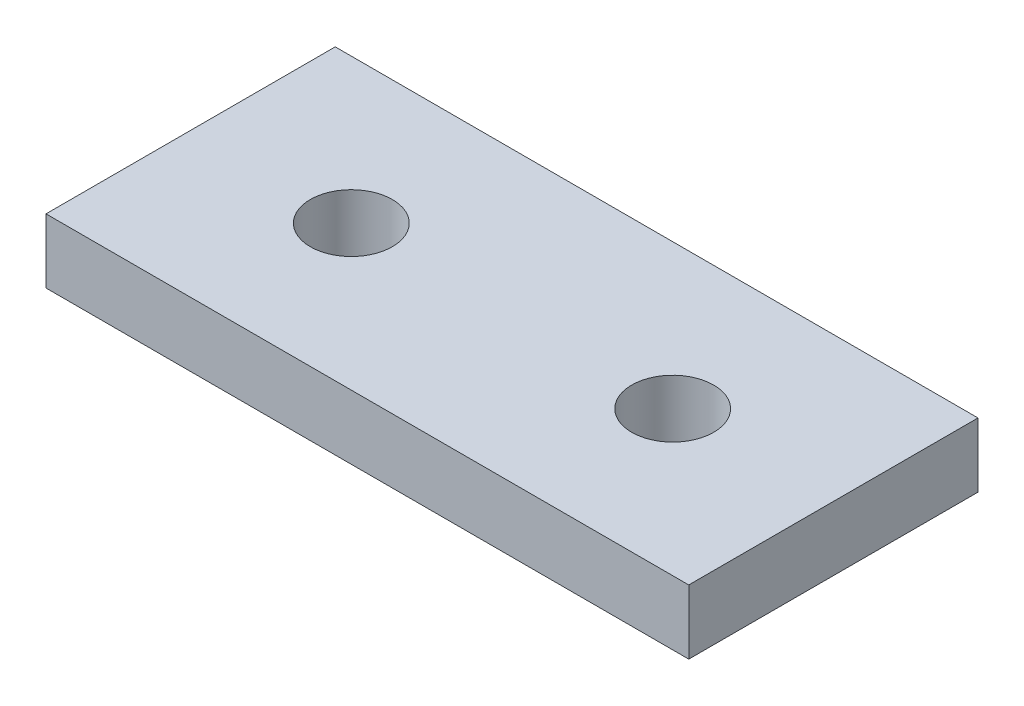
ISO-10303-21;
HEADER;
FILE_DESCRIPTION(('STEP AP214'),'2;1');
FILE_NAME('part.step','',(''),(''),'','','');
FILE_SCHEMA(('AUTOMOTIVE_DESIGN { 1 0 10303 214 1 1 1 1 }'));
ENDSEC;
DATA;
#1=APPLICATION_CONTEXT('core data for automotive mechanical design processes');
#2=APPLICATION_PROTOCOL_DEFINITION('international standard','automotive_design',2000,#1);
#3=PRODUCT_CONTEXT('',#1,'mechanical');
#4=PRODUCT('Part','Part','',(#3));
#5=PRODUCT_RELATED_PRODUCT_CATEGORY('part','',(#4));
#6=PRODUCT_DEFINITION_FORMATION('','',#4);
#7=PRODUCT_DEFINITION_CONTEXT('part definition',#1,'design');
#8=PRODUCT_DEFINITION('design','',#6,#7);
#9=PRODUCT_DEFINITION_SHAPE('','',#8);
#10=(LENGTH_UNIT() NAMED_UNIT(*) SI_UNIT(.MILLI.,.METRE.));
#11=(NAMED_UNIT(*) PLANE_ANGLE_UNIT() SI_UNIT($,.RADIAN.));
#12=(NAMED_UNIT(*) SI_UNIT($,.STERADIAN.) SOLID_ANGLE_UNIT());
#13=UNCERTAINTY_MEASURE_WITH_UNIT(LENGTH_MEASURE(1.E-05),#10,'distance_accuracy_value','');
#14=(GEOMETRIC_REPRESENTATION_CONTEXT(3) GLOBAL_UNCERTAINTY_ASSIGNED_CONTEXT((#13)) GLOBAL_UNIT_ASSIGNED_CONTEXT((#10,
#11,#12)) REPRESENTATION_CONTEXT('',''));
#15=CARTESIAN_POINT('',(0.,0.,0.));
#16=DIRECTION('',(0.,0.,1.));
#17=DIRECTION('',(1.,0.,0.));
#18=AXIS2_PLACEMENT_3D('',#15,#16,#17);
#19=CARTESIAN_POINT('',(0.,4.,0.));
#20=DIRECTION('',(0.,1.,0.));
#21=DIRECTION('',(0.,0.,1.));
#22=AXIS2_PLACEMENT_3D('',#19,#20,#21);
#23=PLANE('',#22);
#24=CARTESIAN_POINT('',(-10.,4.,0.));
#25=DIRECTION('',(0.,1.,0.));
#26=DIRECTION('',(0.,0.,1.));
#27=AXIS2_PLACEMENT_3D('',#24,#25,#26);
#28=CIRCLE('',#27,2.55);
#29=CARTESIAN_POINT('',(-10.,4.,2.55));
#30=VERTEX_POINT('',#29);
#31=EDGE_CURVE('E102',#30,#30,#28,.T.);
#32=ORIENTED_EDGE('',*,*,#31,.F.);
#33=EDGE_LOOP('',(#32));
#34=FACE_BOUND('',#33,.T.);
#35=DIRECTION('',(0.,0.,1.));
#36=VECTOR('',#35,1.);
#37=CARTESIAN_POINT('',(-20.,4.,9.));
#38=LINE('',#37,#36);
#39=CARTESIAN_POINT('',(-20.,4.,-9.));
#40=VERTEX_POINT('',#39);
#41=CARTESIAN_POINT('',(-20.,4.,9.));
#42=VERTEX_POINT('',#41);
#43=EDGE_CURVE('E87',#40,#42,#38,.T.);
#44=ORIENTED_EDGE('',*,*,#43,.T.);
#45=DIRECTION('',(1.,0.,0.));
#46=VECTOR('',#45,1.);
#47=CARTESIAN_POINT('',(20.,4.,8.99999999999999));
#48=LINE('',#47,#46);
#49=CARTESIAN_POINT('',(20.,4.,8.99999999999999));
#50=VERTEX_POINT('',#49);
#51=EDGE_CURVE('E82',#42,#50,#48,.T.);
#52=ORIENTED_EDGE('',*,*,#51,.T.);
#53=DIRECTION('',(0.,0.,-1.));
#54=VECTOR('',#53,1.);
#55=CARTESIAN_POINT('',(20.,4.,8.99999999999999));
#56=LINE('',#55,#54);
#57=CARTESIAN_POINT('',(20.,4.,-9.00000000000001));
#58=VERTEX_POINT('',#57);
#59=EDGE_CURVE('E85',#50,#58,#56,.T.);
#60=ORIENTED_EDGE('',*,*,#59,.T.);
#61=DIRECTION('',(-1.,0.,0.));
#62=VECTOR('',#61,1.);
#63=CARTESIAN_POINT('',(20.,4.,-9.00000000000001));
#64=LINE('',#63,#62);
#65=EDGE_CURVE('E52',#58,#40,#64,.T.);
#66=ORIENTED_EDGE('',*,*,#65,.T.);
#67=EDGE_LOOP('',(#44,#52,#60,#66));
#68=FACE_BOUND('',#67,.T.);
#69=CARTESIAN_POINT('',(9.99999999999999,4.,0.));
#70=DIRECTION('',(0.,1.,0.));
#71=DIRECTION('',(0.,0.,-1.));
#72=AXIS2_PLACEMENT_3D('',#69,#70,#71);
#73=CIRCLE('',#72,2.55);
#74=CARTESIAN_POINT('',(9.99999999999999,4.,-2.55));
#75=VERTEX_POINT('',#74);
#76=EDGE_CURVE('E117',#75,#75,#73,.T.);
#77=ORIENTED_EDGE('',*,*,#76,.F.);
#78=EDGE_LOOP('',(#77));
#79=FACE_BOUND('',#78,.T.);
#80=ADVANCED_FACE('F35',(#34,#68,#79),#23,.T.);
#81=CARTESIAN_POINT('',(0.,0.,0.));
#82=DIRECTION('',(0.,1.,0.));
#83=DIRECTION('',(0.,0.,1.));
#84=AXIS2_PLACEMENT_3D('',#81,#82,#83);
#85=PLANE('',#84);
#86=CARTESIAN_POINT('',(-10.,0.,0.));
#87=DIRECTION('',(0.,1.,0.));
#88=DIRECTION('',(0.,0.,1.));
#89=AXIS2_PLACEMENT_3D('',#86,#87,#88);
#90=CIRCLE('',#89,2.55);
#91=CARTESIAN_POINT('',(-10.,0.,2.55));
#92=VERTEX_POINT('',#91);
#93=EDGE_CURVE('E114',#92,#92,#90,.T.);
#94=ORIENTED_EDGE('',*,*,#93,.T.);
#95=EDGE_LOOP('',(#94));
#96=FACE_BOUND('',#95,.T.);
#97=DIRECTION('',(0.,0.,1.));
#98=VECTOR('',#97,1.);
#99=CARTESIAN_POINT('',(-20.,0.,9.));
#100=LINE('',#99,#98);
#101=CARTESIAN_POINT('',(-20.,0.,-9.));
#102=VERTEX_POINT('',#101);
#103=CARTESIAN_POINT('',(-20.,0.,9.));
#104=VERTEX_POINT('',#103);
#105=EDGE_CURVE('E99',#102,#104,#100,.T.);
#106=ORIENTED_EDGE('',*,*,#105,.F.);
#107=DIRECTION('',(-1.,0.,0.));
#108=VECTOR('',#107,1.);
#109=CARTESIAN_POINT('',(20.,0.,-9.00000000000001));
#110=LINE('',#109,#108);
#111=CARTESIAN_POINT('',(20.,0.,-9.00000000000001));
#112=VERTEX_POINT('',#111);
#113=EDGE_CURVE('E75',#112,#102,#110,.T.);
#114=ORIENTED_EDGE('',*,*,#113,.F.);
#115=DIRECTION('',(0.,0.,-1.));
#116=VECTOR('',#115,1.);
#117=CARTESIAN_POINT('',(20.,0.,8.99999999999999));
#118=LINE('',#117,#116);
#119=CARTESIAN_POINT('',(20.,0.,8.99999999999999));
#120=VERTEX_POINT('',#119);
#121=EDGE_CURVE('E69',#120,#112,#118,.T.);
#122=ORIENTED_EDGE('',*,*,#121,.F.);
#123=DIRECTION('',(1.,0.,0.));
#124=VECTOR('',#123,1.);
#125=CARTESIAN_POINT('',(20.,0.,8.99999999999999));
#126=LINE('',#125,#124);
#127=EDGE_CURVE('E91',#104,#120,#126,.T.);
#128=ORIENTED_EDGE('',*,*,#127,.F.);
#129=EDGE_LOOP('',(#106,#114,#122,#128));
#130=FACE_BOUND('',#129,.T.);
#131=CARTESIAN_POINT('',(9.99999999999999,0.,0.));
#132=DIRECTION('',(0.,1.,0.));
#133=DIRECTION('',(0.,0.,-1.));
#134=AXIS2_PLACEMENT_3D('',#131,#132,#133);
#135=CIRCLE('',#134,2.55);
#136=CARTESIAN_POINT('',(9.99999999999999,0.,-2.55));
#137=VERTEX_POINT('',#136);
#138=EDGE_CURVE('E120',#137,#137,#135,.T.);
#139=ORIENTED_EDGE('',*,*,#138,.T.);
#140=EDGE_LOOP('',(#139));
#141=FACE_BOUND('',#140,.T.);
#142=ADVANCED_FACE('F110',(#96,#130,#141),#85,.F.);
#143=CARTESIAN_POINT('',(-20.,4.,9.));
#144=DIRECTION('',(1.,0.,0.));
#145=DIRECTION('',(0.,0.,-1.));
#146=AXIS2_PLACEMENT_3D('',#143,#144,#145);
#147=PLANE('',#146);
#148=ORIENTED_EDGE('',*,*,#105,.T.);
#149=DIRECTION('',(0.,-1.,0.));
#150=VECTOR('',#149,1.);
#151=CARTESIAN_POINT('',(-20.,4.,9.));
#152=LINE('',#151,#150);
#153=EDGE_CURVE('E11',#42,#104,#152,.T.);
#154=ORIENTED_EDGE('',*,*,#153,.F.);
#155=ORIENTED_EDGE('',*,*,#43,.F.);
#156=DIRECTION('',(0.,-1.,0.));
#157=VECTOR('',#156,1.);
#158=CARTESIAN_POINT('',(-20.,4.,-9.));
#159=LINE('',#158,#157);
#160=EDGE_CURVE('E95',#40,#102,#159,.T.);
#161=ORIENTED_EDGE('',*,*,#160,.T.);
#162=EDGE_LOOP('',(#148,#154,#155,#161));
#163=FACE_BOUND('',#162,.T.);
#164=ADVANCED_FACE('F37',(#163),#147,.F.);
#165=CARTESIAN_POINT('',(20.,4.,8.99999999999999));
#166=DIRECTION('',(0.,0.,-1.));
#167=DIRECTION('',(-1.,0.,0.));
#168=AXIS2_PLACEMENT_3D('',#165,#166,#167);
#169=PLANE('',#168);
#170=ORIENTED_EDGE('',*,*,#127,.T.);
#171=DIRECTION('',(0.,-1.,0.));
#172=VECTOR('',#171,1.);
#173=CARTESIAN_POINT('',(20.,4.,8.99999999999999));
#174=LINE('',#173,#172);
#175=EDGE_CURVE('E44',#50,#120,#174,.T.);
#176=ORIENTED_EDGE('',*,*,#175,.F.);
#177=ORIENTED_EDGE('',*,*,#51,.F.);
#178=ORIENTED_EDGE('',*,*,#153,.T.);
#179=EDGE_LOOP('',(#170,#176,#177,#178));
#180=FACE_BOUND('',#179,.T.);
#181=ADVANCED_FACE('F90',(#180),#169,.F.);
#182=CARTESIAN_POINT('',(20.,4.,8.99999999999999));
#183=DIRECTION('',(-1.,0.,0.));
#184=DIRECTION('',(0.,0.,1.));
#185=AXIS2_PLACEMENT_3D('',#182,#183,#184);
#186=PLANE('',#185);
#187=ORIENTED_EDGE('',*,*,#121,.T.);
#188=DIRECTION('',(0.,-1.,0.));
#189=VECTOR('',#188,1.);
#190=CARTESIAN_POINT('',(20.,4.,-9.00000000000001));
#191=LINE('',#190,#189);
#192=EDGE_CURVE('E92',#58,#112,#191,.T.);
#193=ORIENTED_EDGE('',*,*,#192,.F.);
#194=ORIENTED_EDGE('',*,*,#59,.F.);
#195=ORIENTED_EDGE('',*,*,#175,.T.);
#196=EDGE_LOOP('',(#187,#193,#194,#195));
#197=FACE_BOUND('',#196,.T.);
#198=ADVANCED_FACE('F93',(#197),#186,.F.);
#199=CARTESIAN_POINT('',(20.,4.,-9.00000000000001));
#200=DIRECTION('',(0.,0.,1.));
#201=DIRECTION('',(1.,0.,0.));
#202=AXIS2_PLACEMENT_3D('',#199,#200,#201);
#203=PLANE('',#202);
#204=ORIENTED_EDGE('',*,*,#113,.T.);
#205=ORIENTED_EDGE('',*,*,#160,.F.);
#206=ORIENTED_EDGE('',*,*,#65,.F.);
#207=ORIENTED_EDGE('',*,*,#192,.T.);
#208=EDGE_LOOP('',(#204,#205,#206,#207));
#209=FACE_BOUND('',#208,.T.);
#210=ADVANCED_FACE('F107',(#209),#203,.F.);
#211=CARTESIAN_POINT('',(-10.,4.,0.));
#212=DIRECTION('',(0.,-1.,0.));
#213=DIRECTION('',(0.,0.,-1.));
#214=AXIS2_PLACEMENT_3D('',#211,#212,#213);
#215=CYLINDRICAL_SURFACE('',#214,2.55);
#216=ORIENTED_EDGE('',*,*,#31,.T.);
#217=EDGE_LOOP('',(#216));
#218=FACE_BOUND('',#217,.T.);
#219=ORIENTED_EDGE('',*,*,#93,.F.);
#220=EDGE_LOOP('',(#219));
#221=FACE_BOUND('',#220,.T.);
#222=ADVANCED_FACE('F138',(#218,#221),#215,.F.);
#223=CARTESIAN_POINT('',(9.99999999999999,4.,0.));
#224=DIRECTION('',(0.,-1.,0.));
#225=DIRECTION('',(0.,0.,-1.));
#226=AXIS2_PLACEMENT_3D('',#223,#224,#225);
#227=CYLINDRICAL_SURFACE('',#226,2.55);
#228=ORIENTED_EDGE('',*,*,#76,.T.);
#229=EDGE_LOOP('',(#228));
#230=FACE_BOUND('',#229,.T.);
#231=ORIENTED_EDGE('',*,*,#138,.F.);
#232=EDGE_LOOP('',(#231));
#233=FACE_BOUND('',#232,.T.);
#234=ADVANCED_FACE('F126',(#230,#233),#227,.F.);
#235=CLOSED_SHELL('',(#80,#142,#164,#181,#198,#210,#222,#234));
#236=MANIFOLD_SOLID_BREP('B2',#235);
#237=ADVANCED_BREP_SHAPE_REPRESENTATION('',(#18,#236),#14);
#238=SHAPE_DEFINITION_REPRESENTATION(#9,#237);
ENDSEC;
END-ISO-10303-21;
